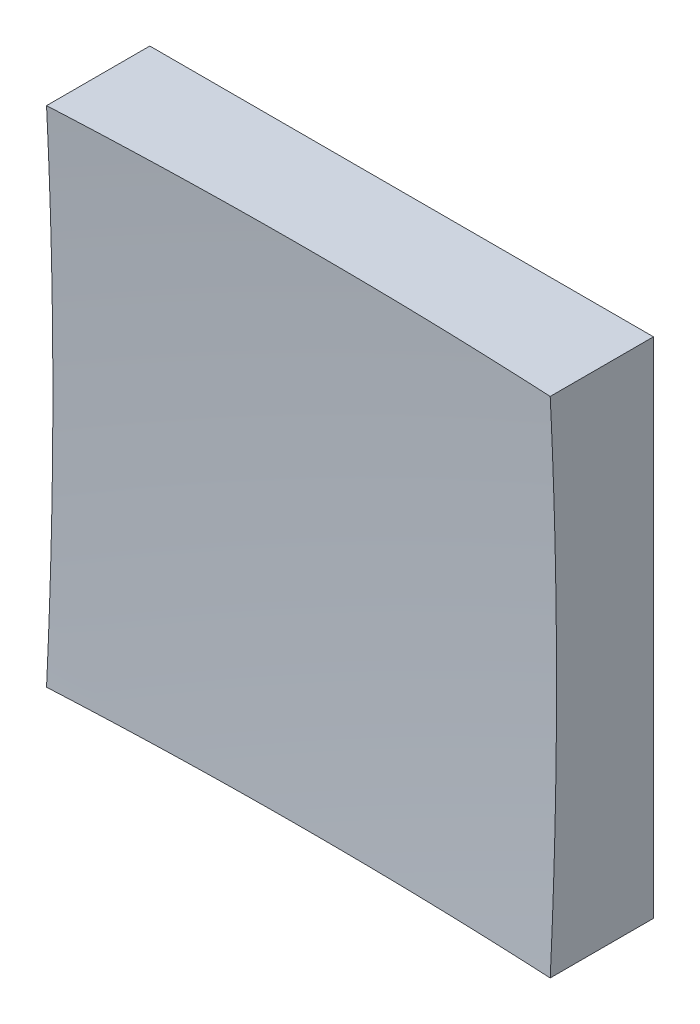
ISO-10303-21;
HEADER;
FILE_DESCRIPTION(('STEP AP214'),'2;1');
FILE_NAME('part.step','',(''),(''),'','','');
FILE_SCHEMA(('AUTOMOTIVE_DESIGN { 1 0 10303 214 1 1 1 1 }'));
ENDSEC;
DATA;
#1=APPLICATION_CONTEXT('core data for automotive mechanical design processes');
#2=APPLICATION_PROTOCOL_DEFINITION('international standard','automotive_design',2000,#1);
#3=PRODUCT_CONTEXT('',#1,'mechanical');
#4=PRODUCT('Part','Part','',(#3));
#5=PRODUCT_RELATED_PRODUCT_CATEGORY('part','',(#4));
#6=PRODUCT_DEFINITION_FORMATION('','',#4);
#7=PRODUCT_DEFINITION_CONTEXT('part definition',#1,'design');
#8=PRODUCT_DEFINITION('design','',#6,#7);
#9=PRODUCT_DEFINITION_SHAPE('','',#8);
#10=(LENGTH_UNIT() NAMED_UNIT(*) SI_UNIT(.MILLI.,.METRE.));
#11=(NAMED_UNIT(*) PLANE_ANGLE_UNIT() SI_UNIT($,.RADIAN.));
#12=(NAMED_UNIT(*) SI_UNIT($,.STERADIAN.) SOLID_ANGLE_UNIT());
#13=UNCERTAINTY_MEASURE_WITH_UNIT(LENGTH_MEASURE(1.E-05),#10,'distance_accuracy_value','');
#14=(GEOMETRIC_REPRESENTATION_CONTEXT(3) GLOBAL_UNCERTAINTY_ASSIGNED_CONTEXT((#13)) GLOBAL_UNIT_ASSIGNED_CONTEXT((#10,
#11,#12)) REPRESENTATION_CONTEXT('',''));
#15=CARTESIAN_POINT('',(0.,0.,0.));
#16=DIRECTION('',(0.,0.,1.));
#17=DIRECTION('',(1.,0.,0.));
#18=AXIS2_PLACEMENT_3D('',#15,#16,#17);
#19=CARTESIAN_POINT('',(-25.,25.,50.));
#20=DIRECTION('',(0.,1.,0.));
#21=DIRECTION('',(0.,0.,1.));
#22=AXIS2_PLACEMENT_3D('',#19,#20,#21);
#23=PLANE('',#22);
#24=CARTESIAN_POINT('',(0.,25.,509.));
#25=DIRECTION('',(0.,1.,0.));
#26=DIRECTION('',(0.,0.,1.));
#27=AXIS2_PLACEMENT_3D('',#24,#25,#26);
#28=CIRCLE('',#27,499.374608885955);
#29=CARTESIAN_POINT('',(25.,25.,10.2515664184999));
#30=VERTEX_POINT('',#29);
#31=CARTESIAN_POINT('',(-25.,25.,10.2515664184999));
#32=VERTEX_POINT('',#31);
#33=EDGE_CURVE('E87',#30,#32,#28,.T.);
#34=ORIENTED_EDGE('',*,*,#33,.F.);
#35=DIRECTION('',(0.,0.,-1.));
#36=VECTOR('',#35,1.);
#37=CARTESIAN_POINT('',(25.,25.,50.));
#38=LINE('',#37,#36);
#39=CARTESIAN_POINT('',(25.,25.,0.));
#40=VERTEX_POINT('',#39);
#41=EDGE_CURVE('E93',#30,#40,#38,.T.);
#42=ORIENTED_EDGE('',*,*,#41,.T.);
#43=DIRECTION('',(1.,0.,0.));
#44=VECTOR('',#43,1.);
#45=CARTESIAN_POINT('',(-25.,25.,0.));
#46=LINE('',#45,#44);
#47=CARTESIAN_POINT('',(-25.,25.,0.));
#48=VERTEX_POINT('',#47);
#49=EDGE_CURVE('E96',#48,#40,#46,.T.);
#50=ORIENTED_EDGE('',*,*,#49,.F.);
#51=DIRECTION('',(0.,0.,-1.));
#52=VECTOR('',#51,1.);
#53=CARTESIAN_POINT('',(-25.,25.,50.));
#54=LINE('',#53,#52);
#55=EDGE_CURVE('E55',#32,#48,#54,.T.);
#56=ORIENTED_EDGE('',*,*,#55,.F.);
#57=EDGE_LOOP('',(#34,#42,#50,#56));
#58=FACE_BOUND('',#57,.T.);
#59=ADVANCED_FACE('F47',(#58),#23,.T.);
#60=CARTESIAN_POINT('',(-25.,25.,50.));
#61=DIRECTION('',(1.,0.,0.));
#62=DIRECTION('',(0.,1.,0.));
#63=AXIS2_PLACEMENT_3D('',#60,#61,#62);
#64=PLANE('',#63);
#65=DIRECTION('',(0.,0.,-1.));
#66=VECTOR('',#65,1.);
#67=CARTESIAN_POINT('',(-25.,-25.,50.));
#68=LINE('',#67,#66);
#69=CARTESIAN_POINT('',(-25.,-25.,10.2515664184999));
#70=VERTEX_POINT('',#69);
#71=CARTESIAN_POINT('',(-25.,-25.,0.));
#72=VERTEX_POINT('',#71);
#73=EDGE_CURVE('E110',#70,#72,#68,.T.);
#74=ORIENTED_EDGE('',*,*,#73,.F.);
#75=CARTESIAN_POINT('',(-25.,0.,509.));
#76=DIRECTION('',(1.,0.,0.));
#77=DIRECTION('',(0.,1.,0.));
#78=AXIS2_PLACEMENT_3D('',#75,#76,#77);
#79=CIRCLE('',#78,499.374608885955);
#80=EDGE_CURVE('E97',#70,#32,#79,.T.);
#81=ORIENTED_EDGE('',*,*,#80,.T.);
#82=ORIENTED_EDGE('',*,*,#55,.T.);
#83=DIRECTION('',(0.,-1.,0.));
#84=VECTOR('',#83,1.);
#85=CARTESIAN_POINT('',(-25.,25.,0.));
#86=LINE('',#85,#84);
#87=EDGE_CURVE('E105',#48,#72,#86,.T.);
#88=ORIENTED_EDGE('',*,*,#87,.T.);
#89=EDGE_LOOP('',(#74,#81,#82,#88));
#90=FACE_BOUND('',#89,.T.);
#91=ADVANCED_FACE('F132',(#90),#64,.F.);
#92=CARTESIAN_POINT('',(-25.,-25.,50.));
#93=DIRECTION('',(0.,1.,0.));
#94=DIRECTION('',(0.,0.,1.));
#95=AXIS2_PLACEMENT_3D('',#92,#93,#94);
#96=PLANE('',#95);
#97=DIRECTION('',(0.,0.,-1.));
#98=VECTOR('',#97,1.);
#99=CARTESIAN_POINT('',(25.,-25.,50.));
#100=LINE('',#99,#98);
#101=CARTESIAN_POINT('',(25.,-25.,10.2515664184999));
#102=VERTEX_POINT('',#101);
#103=CARTESIAN_POINT('',(25.,-25.,0.));
#104=VERTEX_POINT('',#103);
#105=EDGE_CURVE('E104',#102,#104,#100,.T.);
#106=ORIENTED_EDGE('',*,*,#105,.F.);
#107=CARTESIAN_POINT('',(0.,-25.,509.));
#108=DIRECTION('',(0.,1.,0.));
#109=DIRECTION('',(0.,0.,1.));
#110=AXIS2_PLACEMENT_3D('',#107,#108,#109);
#111=CIRCLE('',#110,499.374608885955);
#112=EDGE_CURVE('E61',#102,#70,#111,.T.);
#113=ORIENTED_EDGE('',*,*,#112,.T.);
#114=ORIENTED_EDGE('',*,*,#73,.T.);
#115=DIRECTION('',(1.,0.,0.));
#116=VECTOR('',#115,1.);
#117=CARTESIAN_POINT('',(-25.,-25.,0.));
#118=LINE('',#117,#116);
#119=EDGE_CURVE('E113',#72,#104,#118,.T.);
#120=ORIENTED_EDGE('',*,*,#119,.T.);
#121=EDGE_LOOP('',(#106,#113,#114,#120));
#122=FACE_BOUND('',#121,.T.);
#123=ADVANCED_FACE('F131',(#122),#96,.F.);
#124=CARTESIAN_POINT('',(25.,25.,50.));
#125=DIRECTION('',(1.,0.,0.));
#126=DIRECTION('',(0.,1.,0.));
#127=AXIS2_PLACEMENT_3D('',#124,#125,#126);
#128=PLANE('',#127);
#129=CARTESIAN_POINT('',(25.,0.,509.));
#130=DIRECTION('',(1.,0.,0.));
#131=DIRECTION('',(0.,1.,0.));
#132=AXIS2_PLACEMENT_3D('',#129,#130,#131);
#133=CIRCLE('',#132,499.374608885955);
#134=EDGE_CURVE('E11',#102,#30,#133,.T.);
#135=ORIENTED_EDGE('',*,*,#134,.F.);
#136=ORIENTED_EDGE('',*,*,#105,.T.);
#137=DIRECTION('',(0.,-1.,0.));
#138=VECTOR('',#137,1.);
#139=CARTESIAN_POINT('',(25.,25.,0.));
#140=LINE('',#139,#138);
#141=EDGE_CURVE('E101',#40,#104,#140,.T.);
#142=ORIENTED_EDGE('',*,*,#141,.F.);
#143=ORIENTED_EDGE('',*,*,#41,.F.);
#144=EDGE_LOOP('',(#135,#136,#142,#143));
#145=FACE_BOUND('',#144,.T.);
#146=ADVANCED_FACE('F99',(#145),#128,.T.);
#147=CARTESIAN_POINT('',(0.,0.,0.));
#148=DIRECTION('',(0.,0.,-1.));
#149=DIRECTION('',(-1.,0.,0.));
#150=AXIS2_PLACEMENT_3D('',#147,#148,#149);
#151=PLANE('',#150);
#152=ORIENTED_EDGE('',*,*,#49,.T.);
#153=ORIENTED_EDGE('',*,*,#141,.T.);
#154=ORIENTED_EDGE('',*,*,#119,.F.);
#155=ORIENTED_EDGE('',*,*,#87,.F.);
#156=EDGE_LOOP('',(#152,#153,#154,#155));
#157=FACE_BOUND('',#156,.T.);
#158=ADVANCED_FACE('F135',(#157),#151,.T.);
#159=CARTESIAN_POINT('',(0.,0.,509.));
#160=DIRECTION('',(0.,0.,1.));
#161=DIRECTION('',(1.,0.,0.));
#162=AXIS2_PLACEMENT_3D('',#159,#160,#161);
#163=SPHERICAL_SURFACE('',#162,500.);
#164=ORIENTED_EDGE('',*,*,#33,.T.);
#165=ORIENTED_EDGE('',*,*,#80,.F.);
#166=ORIENTED_EDGE('',*,*,#112,.F.);
#167=ORIENTED_EDGE('',*,*,#134,.T.);
#168=EDGE_LOOP('',(#164,#165,#166,#167));
#169=FACE_BOUND('',#168,.T.);
#170=ADVANCED_FACE('F86',(#169),#163,.F.);
#171=CLOSED_SHELL('',(#59,#91,#123,#146,#158,#170));
#172=MANIFOLD_SOLID_BREP('B2',#171);
#173=ADVANCED_BREP_SHAPE_REPRESENTATION('',(#18,#172),#14);
#174=SHAPE_DEFINITION_REPRESENTATION(#9,#173);
ENDSEC;
END-ISO-10303-21;
